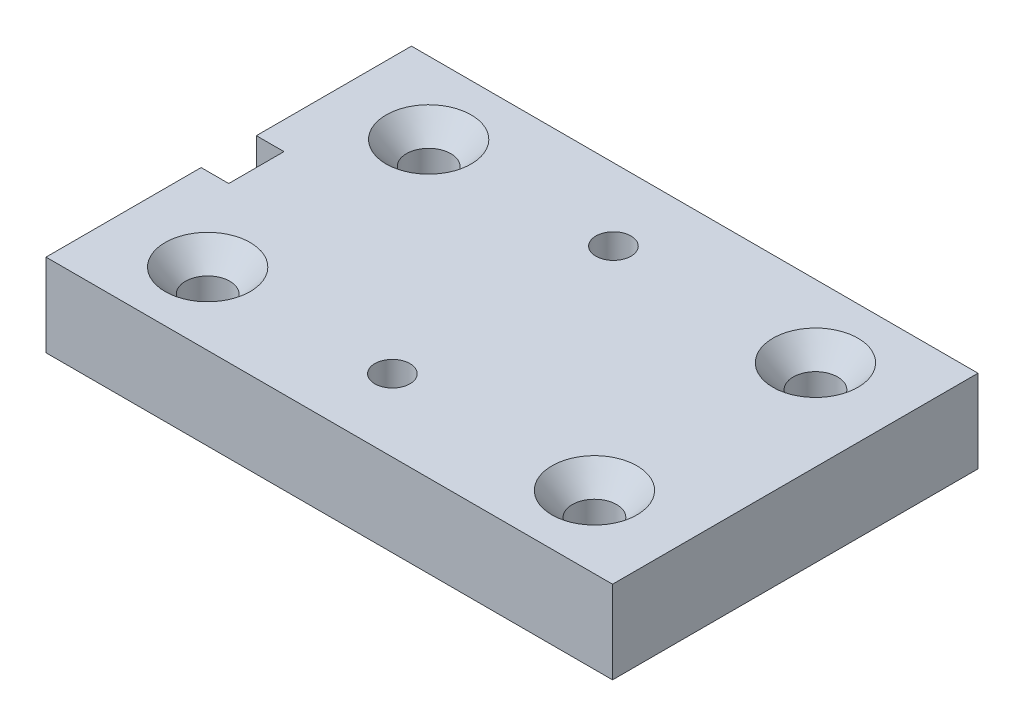
ISO-10303-21;
HEADER;
FILE_DESCRIPTION(('STEP AP214'),'2;1');
FILE_NAME('part.step','',(''),(''),'','','');
FILE_SCHEMA(('AUTOMOTIVE_DESIGN { 1 0 10303 214 1 1 1 1 }'));
ENDSEC;
DATA;
#1=APPLICATION_CONTEXT('core data for automotive mechanical design processes');
#2=APPLICATION_PROTOCOL_DEFINITION('international standard','automotive_design',2000,#1);
#3=PRODUCT_CONTEXT('',#1,'mechanical');
#4=PRODUCT('Part','Part','',(#3));
#5=PRODUCT_RELATED_PRODUCT_CATEGORY('part','',(#4));
#6=PRODUCT_DEFINITION_FORMATION('','',#4);
#7=PRODUCT_DEFINITION_CONTEXT('part definition',#1,'design');
#8=PRODUCT_DEFINITION('design','',#6,#7);
#9=PRODUCT_DEFINITION_SHAPE('','',#8);
#10=(LENGTH_UNIT() NAMED_UNIT(*) SI_UNIT(.MILLI.,.METRE.));
#11=(NAMED_UNIT(*) PLANE_ANGLE_UNIT() SI_UNIT($,.RADIAN.));
#12=(NAMED_UNIT(*) SI_UNIT($,.STERADIAN.) SOLID_ANGLE_UNIT());
#13=UNCERTAINTY_MEASURE_WITH_UNIT(LENGTH_MEASURE(1.E-05),#10,'distance_accuracy_value','');
#14=(GEOMETRIC_REPRESENTATION_CONTEXT(3) GLOBAL_UNCERTAINTY_ASSIGNED_CONTEXT((#13)) GLOBAL_UNIT_ASSIGNED_CONTEXT((#10,
#11,#12)) REPRESENTATION_CONTEXT('',''));
#15=CARTESIAN_POINT('',(0.,0.,0.));
#16=DIRECTION('',(0.,0.,1.));
#17=DIRECTION('',(1.,0.,0.));
#18=AXIS2_PLACEMENT_3D('',#15,#16,#17);
#19=CARTESIAN_POINT('',(-65.110000082,9.525,0.));
#20=DIRECTION('',(1.,0.,0.));
#21=DIRECTION('',(0.,0.,-1.));
#22=AXIS2_PLACEMENT_3D('',#19,#20,#21);
#23=PLANE('',#22);
#24=DIRECTION('',(0.,0.,1.));
#25=VECTOR('',#24,1.);
#26=CARTESIAN_POINT('',(-65.110000082,0.,0.));
#27=LINE('',#26,#25);
#28=CARTESIAN_POINT('',(-65.110000082,0.,-42.));
#29=VERTEX_POINT('',#28);
#30=CARTESIAN_POINT('',(-65.110000082,0.,-24.175));
#31=VERTEX_POINT('',#30);
#32=EDGE_CURVE('E129',#29,#31,#27,.T.);
#33=ORIENTED_EDGE('',*,*,#32,.T.);
#34=DIRECTION('',(0.,1.,0.));
#35=VECTOR('',#34,1.);
#36=CARTESIAN_POINT('',(-65.110000082,0.,-24.175));
#37=LINE('',#36,#35);
#38=CARTESIAN_POINT('',(-65.110000082,9.525,-24.175));
#39=VERTEX_POINT('',#38);
#40=EDGE_CURVE('E162',#31,#39,#37,.T.);
#41=ORIENTED_EDGE('',*,*,#40,.T.);
#42=DIRECTION('',(0.,0.,1.));
#43=VECTOR('',#42,1.);
#44=CARTESIAN_POINT('',(-65.110000082,9.525,0.));
#45=LINE('',#44,#43);
#46=CARTESIAN_POINT('',(-65.110000082,9.525,-42.));
#47=VERTEX_POINT('',#46);
#48=EDGE_CURVE('E148',#47,#39,#45,.T.);
#49=ORIENTED_EDGE('',*,*,#48,.F.);
#50=DIRECTION('',(0.,-1.,0.));
#51=VECTOR('',#50,1.);
#52=CARTESIAN_POINT('',(-65.110000082,9.525,-42.));
#53=LINE('',#52,#51);
#54=EDGE_CURVE('E43',#47,#29,#53,.T.);
#55=ORIENTED_EDGE('',*,*,#54,.T.);
#56=EDGE_LOOP('',(#33,#41,#49,#55));
#57=FACE_BOUND('',#56,.T.);
#58=ADVANCED_FACE('F35',(#57),#23,.F.);
#59=CARTESIAN_POINT('',(0.,9.525,0.));
#60=DIRECTION('',(-1.,0.,0.));
#61=DIRECTION('',(0.,0.,1.));
#62=AXIS2_PLACEMENT_3D('',#59,#60,#61);
#63=PLANE('',#62);
#64=DIRECTION('',(0.,0.,-1.));
#65=VECTOR('',#64,1.);
#66=CARTESIAN_POINT('',(0.,0.,0.));
#67=LINE('',#66,#65);
#68=CARTESIAN_POINT('',(0.,0.,0.));
#69=VERTEX_POINT('',#68);
#70=CARTESIAN_POINT('',(0.,0.,-42.));
#71=VERTEX_POINT('',#70);
#72=EDGE_CURVE('E133',#69,#71,#67,.T.);
#73=ORIENTED_EDGE('',*,*,#72,.T.);
#74=DIRECTION('',(0.,-1.,0.));
#75=VECTOR('',#74,1.);
#76=CARTESIAN_POINT('',(0.,9.525,-42.));
#77=LINE('',#76,#75);
#78=CARTESIAN_POINT('',(0.,9.525,-42.));
#79=VERTEX_POINT('',#78);
#80=EDGE_CURVE('E11',#79,#71,#77,.T.);
#81=ORIENTED_EDGE('',*,*,#80,.F.);
#82=DIRECTION('',(0.,0.,-1.));
#83=VECTOR('',#82,1.);
#84=CARTESIAN_POINT('',(0.,9.525,0.));
#85=LINE('',#84,#83);
#86=CARTESIAN_POINT('',(0.,9.525,0.));
#87=VERTEX_POINT('',#86);
#88=EDGE_CURVE('E138',#87,#79,#85,.T.);
#89=ORIENTED_EDGE('',*,*,#88,.F.);
#90=DIRECTION('',(0.,-1.,0.));
#91=VECTOR('',#90,1.);
#92=CARTESIAN_POINT('',(0.,9.525,0.));
#93=LINE('',#92,#91);
#94=EDGE_CURVE('E139',#87,#69,#93,.T.);
#95=ORIENTED_EDGE('',*,*,#94,.T.);
#96=EDGE_LOOP('',(#73,#81,#89,#95));
#97=FACE_BOUND('',#96,.T.);
#98=ADVANCED_FACE('F37',(#97),#63,.F.);
#99=CARTESIAN_POINT('',(0.,9.525,-42.));
#100=DIRECTION('',(0.,0.,1.));
#101=DIRECTION('',(1.,0.,0.));
#102=AXIS2_PLACEMENT_3D('',#99,#100,#101);
#103=PLANE('',#102);
#104=DIRECTION('',(-1.,0.,0.));
#105=VECTOR('',#104,1.);
#106=CARTESIAN_POINT('',(0.,0.,-42.));
#107=LINE('',#106,#105);
#108=EDGE_CURVE('E130',#71,#29,#107,.T.);
#109=ORIENTED_EDGE('',*,*,#108,.T.);
#110=ORIENTED_EDGE('',*,*,#54,.F.);
#111=DIRECTION('',(-1.,0.,0.));
#112=VECTOR('',#111,1.);
#113=CARTESIAN_POINT('',(0.,9.525,-42.));
#114=LINE('',#113,#112);
#115=EDGE_CURVE('E87',#79,#47,#114,.T.);
#116=ORIENTED_EDGE('',*,*,#115,.F.);
#117=ORIENTED_EDGE('',*,*,#80,.T.);
#118=EDGE_LOOP('',(#109,#110,#116,#117));
#119=FACE_BOUND('',#118,.T.);
#120=ADVANCED_FACE('F222',(#119),#103,.F.);
#121=CARTESIAN_POINT('',(-65.110000082,9.525,-17.825));
#122=VERTEX_POINT('',#121);
#123=CARTESIAN_POINT('',(-65.110000082,9.525,0.));
#124=VERTEX_POINT('',#123);
#125=EDGE_CURVE('E124',#122,#124,#45,.T.);
#126=ORIENTED_EDGE('',*,*,#125,.F.);
#127=DIRECTION('',(0.,1.,0.));
#128=VECTOR('',#127,1.);
#129=CARTESIAN_POINT('',(-65.110000082,0.,-17.825));
#130=LINE('',#129,#128);
#131=CARTESIAN_POINT('',(-65.110000082,0.,-17.825));
#132=VERTEX_POINT('',#131);
#133=EDGE_CURVE('E112',#132,#122,#130,.T.);
#134=ORIENTED_EDGE('',*,*,#133,.F.);
#135=CARTESIAN_POINT('',(-65.110000082,0.,0.));
#136=VERTEX_POINT('',#135);
#137=EDGE_CURVE('E123',#132,#136,#27,.T.);
#138=ORIENTED_EDGE('',*,*,#137,.T.);
#139=DIRECTION('',(0.,-1.,0.));
#140=VECTOR('',#139,1.);
#141=CARTESIAN_POINT('',(-65.110000082,9.525,0.));
#142=LINE('',#141,#140);
#143=EDGE_CURVE('E141',#124,#136,#142,.T.);
#144=ORIENTED_EDGE('',*,*,#143,.F.);
#145=EDGE_LOOP('',(#126,#134,#138,#144));
#146=FACE_BOUND('',#145,.T.);
#147=ADVANCED_FACE('F121',(#146),#23,.F.);
#148=CARTESIAN_POINT('',(0.,9.525,0.));
#149=DIRECTION('',(0.,0.,-1.));
#150=DIRECTION('',(-1.,0.,0.));
#151=AXIS2_PLACEMENT_3D('',#148,#149,#150);
#152=PLANE('',#151);
#153=DIRECTION('',(1.,0.,0.));
#154=VECTOR('',#153,1.);
#155=CARTESIAN_POINT('',(0.,0.,0.));
#156=LINE('',#155,#154);
#157=EDGE_CURVE('E80',#136,#69,#156,.T.);
#158=ORIENTED_EDGE('',*,*,#157,.T.);
#159=ORIENTED_EDGE('',*,*,#94,.F.);
#160=DIRECTION('',(1.,0.,0.));
#161=VECTOR('',#160,1.);
#162=CARTESIAN_POINT('',(0.,9.525,0.));
#163=LINE('',#162,#161);
#164=EDGE_CURVE('E59',#124,#87,#163,.T.);
#165=ORIENTED_EDGE('',*,*,#164,.F.);
#166=ORIENTED_EDGE('',*,*,#143,.T.);
#167=EDGE_LOOP('',(#158,#159,#165,#166));
#168=FACE_BOUND('',#167,.T.);
#169=ADVANCED_FACE('F210',(#168),#152,.F.);
#170=CARTESIAN_POINT('',(0.,9.525,0.));
#171=DIRECTION('',(0.,1.,0.));
#172=DIRECTION('',(0.,0.,1.));
#173=AXIS2_PLACEMENT_3D('',#170,#171,#172);
#174=PLANE('',#173);
#175=CARTESIAN_POINT('',(-33.600000082,9.525,-33.7));
#176=DIRECTION('',(0.,1.,0.));
#177=DIRECTION('',(0.,0.,1.));
#178=AXIS2_PLACEMENT_3D('',#175,#176,#177);
#179=CIRCLE('',#178,2.0193);
#180=CARTESIAN_POINT('',(-33.600000082,9.525,-31.6807));
#181=VERTEX_POINT('',#180);
#182=EDGE_CURVE('E426',#181,#181,#179,.T.);
#183=ORIENTED_EDGE('',*,*,#182,.F.);
#184=EDGE_LOOP('',(#183));
#185=FACE_BOUND('',#184,.T.);
#186=CARTESIAN_POINT('',(-33.600000082,9.525,-8.3));
#187=DIRECTION('',(0.,1.,0.));
#188=DIRECTION('',(0.,0.,1.));
#189=AXIS2_PLACEMENT_3D('',#186,#187,#188);
#190=CIRCLE('',#189,2.0193);
#191=CARTESIAN_POINT('',(-33.600000082,9.525,-6.2807));
#192=VERTEX_POINT('',#191);
#193=EDGE_CURVE('E158',#192,#192,#190,.T.);
#194=ORIENTED_EDGE('',*,*,#193,.F.);
#195=EDGE_LOOP('',(#194));
#196=FACE_BOUND('',#195,.T.);
#197=DIRECTION('',(-1.,0.,0.));
#198=VECTOR('',#197,1.);
#199=CARTESIAN_POINT('',(-65.110000082,9.525,-24.175));
#200=LINE('',#199,#198);
#201=CARTESIAN_POINT('',(-61.935000082,9.525,-24.175));
#202=VERTEX_POINT('',#201);
#203=EDGE_CURVE('E117',#202,#39,#200,.T.);
#204=ORIENTED_EDGE('',*,*,#203,.F.);
#205=DIRECTION('',(0.,0.,-1.));
#206=VECTOR('',#205,1.);
#207=CARTESIAN_POINT('',(-61.935000082,9.525,-24.175));
#208=LINE('',#207,#206);
#209=CARTESIAN_POINT('',(-61.935000082,9.525,-17.825));
#210=VERTEX_POINT('',#209);
#211=EDGE_CURVE('E157',#210,#202,#208,.T.);
#212=ORIENTED_EDGE('',*,*,#211,.F.);
#213=DIRECTION('',(1.,0.,0.));
#214=VECTOR('',#213,1.);
#215=CARTESIAN_POINT('',(-65.110000082,9.525,-17.825));
#216=LINE('',#215,#214);
#217=EDGE_CURVE('E155',#122,#210,#216,.T.);
#218=ORIENTED_EDGE('',*,*,#217,.F.);
#219=ORIENTED_EDGE('',*,*,#125,.T.);
#220=ORIENTED_EDGE('',*,*,#164,.T.);
#221=ORIENTED_EDGE('',*,*,#88,.T.);
#222=ORIENTED_EDGE('',*,*,#115,.T.);
#223=ORIENTED_EDGE('',*,*,#48,.T.);
#224=EDGE_LOOP('',(#204,#212,#218,#219,#220,#221,#222,#223));
#225=FACE_BOUND('',#224,.T.);
#226=CARTESIAN_POINT('',(-54.830000082,9.525,-33.7));
#227=DIRECTION('',(0.,1.,0.));
#228=DIRECTION('',(0.,0.,1.));
#229=AXIS2_PLACEMENT_3D('',#226,#227,#228);
#230=CIRCLE('',#229,4.8895);
#231=CARTESIAN_POINT('',(-54.830000082,9.525,-28.8105));
#232=VERTEX_POINT('',#231);
#233=EDGE_CURVE('E164',#232,#232,#230,.T.);
#234=ORIENTED_EDGE('',*,*,#233,.F.);
#235=EDGE_LOOP('',(#234));
#236=FACE_BOUND('',#235,.T.);
#237=CARTESIAN_POINT('',(-54.830000082,9.525,-8.29999999999999));
#238=DIRECTION('',(0.,1.,0.));
#239=DIRECTION('',(0.,0.,1.));
#240=AXIS2_PLACEMENT_3D('',#237,#238,#239);
#241=CIRCLE('',#240,4.8895);
#242=CARTESIAN_POINT('',(-54.830000082,9.525,-3.41049999999999));
#243=VERTEX_POINT('',#242);
#244=EDGE_CURVE('E176',#243,#243,#241,.T.);
#245=ORIENTED_EDGE('',*,*,#244,.F.);
#246=EDGE_LOOP('',(#245));
#247=FACE_BOUND('',#246,.T.);
#248=CARTESIAN_POINT('',(-10.3799894,9.525,-8.3));
#249=DIRECTION('',(0.,1.,0.));
#250=DIRECTION('',(0.,0.,1.));
#251=AXIS2_PLACEMENT_3D('',#248,#249,#250);
#252=CIRCLE('',#251,4.8895);
#253=CARTESIAN_POINT('',(-10.3799894,9.525,-3.4105));
#254=VERTEX_POINT('',#253);
#255=EDGE_CURVE('E185',#254,#254,#252,.T.);
#256=ORIENTED_EDGE('',*,*,#255,.F.);
#257=EDGE_LOOP('',(#256));
#258=FACE_BOUND('',#257,.T.);
#259=CARTESIAN_POINT('',(-10.3799894,9.525,-33.7));
#260=DIRECTION('',(0.,1.,0.));
#261=DIRECTION('',(0.,0.,1.));
#262=AXIS2_PLACEMENT_3D('',#259,#260,#261);
#263=CIRCLE('',#262,4.8895);
#264=CARTESIAN_POINT('',(-10.3799894,9.525,-28.8105));
#265=VERTEX_POINT('',#264);
#266=EDGE_CURVE('E194',#265,#265,#263,.T.);
#267=ORIENTED_EDGE('',*,*,#266,.F.);
#268=EDGE_LOOP('',(#267));
#269=FACE_BOUND('',#268,.T.);
#270=ADVANCED_FACE('F212',(#185,#196,#225,#236,#247,#258,#269),#174,.T.);
#271=CARTESIAN_POINT('',(0.,0.,0.));
#272=DIRECTION('',(0.,1.,0.));
#273=DIRECTION('',(0.,0.,1.));
#274=AXIS2_PLACEMENT_3D('',#271,#272,#273);
#275=PLANE('',#274);
#276=CARTESIAN_POINT('',(-33.600000082,0.,-33.7));
#277=DIRECTION('',(0.,1.,0.));
#278=DIRECTION('',(0.,0.,1.));
#279=AXIS2_PLACEMENT_3D('',#276,#277,#278);
#280=CIRCLE('',#279,2.0193);
#281=CARTESIAN_POINT('',(-33.600000082,0.,-31.6807));
#282=VERTEX_POINT('',#281);
#283=EDGE_CURVE('E423',#282,#282,#280,.T.);
#284=ORIENTED_EDGE('',*,*,#283,.T.);
#285=EDGE_LOOP('',(#284));
#286=FACE_BOUND('',#285,.T.);
#287=CARTESIAN_POINT('',(-33.600000082,0.,-8.3));
#288=DIRECTION('',(0.,1.,0.));
#289=DIRECTION('',(0.,0.,1.));
#290=AXIS2_PLACEMENT_3D('',#287,#288,#289);
#291=CIRCLE('',#290,2.0193);
#292=CARTESIAN_POINT('',(-33.600000082,0.,-6.2807));
#293=VERTEX_POINT('',#292);
#294=EDGE_CURVE('E427',#293,#293,#291,.T.);
#295=ORIENTED_EDGE('',*,*,#294,.T.);
#296=EDGE_LOOP('',(#295));
#297=FACE_BOUND('',#296,.T.);
#298=CARTESIAN_POINT('',(-54.830000082,0.,-33.7));
#299=DIRECTION('',(0.,1.,0.));
#300=DIRECTION('',(0.,0.,1.));
#301=AXIS2_PLACEMENT_3D('',#298,#299,#300);
#302=CIRCLE('',#301,2.5527);
#303=CARTESIAN_POINT('',(-54.830000082,0.,-31.1473));
#304=VERTEX_POINT('',#303);
#305=EDGE_CURVE('E173',#304,#304,#302,.T.);
#306=ORIENTED_EDGE('',*,*,#305,.T.);
#307=EDGE_LOOP('',(#306));
#308=FACE_BOUND('',#307,.T.);
#309=CARTESIAN_POINT('',(-54.830000082,0.,-8.29999999999999));
#310=DIRECTION('',(0.,1.,0.));
#311=DIRECTION('',(0.,0.,1.));
#312=AXIS2_PLACEMENT_3D('',#309,#310,#311);
#313=CIRCLE('',#312,2.5527);
#314=CARTESIAN_POINT('',(-54.830000082,0.,-5.74729999999999));
#315=VERTEX_POINT('',#314);
#316=EDGE_CURVE('E182',#315,#315,#313,.T.);
#317=ORIENTED_EDGE('',*,*,#316,.T.);
#318=EDGE_LOOP('',(#317));
#319=FACE_BOUND('',#318,.T.);
#320=CARTESIAN_POINT('',(-10.3799894,0.,-8.3));
#321=DIRECTION('',(0.,1.,0.));
#322=DIRECTION('',(0.,0.,1.));
#323=AXIS2_PLACEMENT_3D('',#320,#321,#322);
#324=CIRCLE('',#323,2.5527);
#325=CARTESIAN_POINT('',(-10.3799894,0.,-5.7473));
#326=VERTEX_POINT('',#325);
#327=EDGE_CURVE('E191',#326,#326,#324,.T.);
#328=ORIENTED_EDGE('',*,*,#327,.T.);
#329=EDGE_LOOP('',(#328));
#330=FACE_BOUND('',#329,.T.);
#331=CARTESIAN_POINT('',(-10.3799894,0.,-33.7));
#332=DIRECTION('',(0.,1.,0.));
#333=DIRECTION('',(0.,0.,1.));
#334=AXIS2_PLACEMENT_3D('',#331,#332,#333);
#335=CIRCLE('',#334,2.5527);
#336=CARTESIAN_POINT('',(-10.3799894,0.,-31.1473));
#337=VERTEX_POINT('',#336);
#338=EDGE_CURVE('E200',#337,#337,#335,.T.);
#339=ORIENTED_EDGE('',*,*,#338,.T.);
#340=EDGE_LOOP('',(#339));
#341=FACE_BOUND('',#340,.T.);
#342=DIRECTION('',(0.,0.,-1.));
#343=VECTOR('',#342,1.);
#344=CARTESIAN_POINT('',(-61.935000082,0.,-24.175));
#345=LINE('',#344,#343);
#346=CARTESIAN_POINT('',(-61.935000082,0.,-17.825));
#347=VERTEX_POINT('',#346);
#348=CARTESIAN_POINT('',(-61.935000082,0.,-24.175));
#349=VERTEX_POINT('',#348);
#350=EDGE_CURVE('E50',#347,#349,#345,.T.);
#351=ORIENTED_EDGE('',*,*,#350,.T.);
#352=DIRECTION('',(-1.,0.,0.));
#353=VECTOR('',#352,1.);
#354=CARTESIAN_POINT('',(-65.110000082,0.,-24.175));
#355=LINE('',#354,#353);
#356=EDGE_CURVE('E125',#349,#31,#355,.T.);
#357=ORIENTED_EDGE('',*,*,#356,.T.);
#358=ORIENTED_EDGE('',*,*,#32,.F.);
#359=ORIENTED_EDGE('',*,*,#108,.F.);
#360=ORIENTED_EDGE('',*,*,#72,.F.);
#361=ORIENTED_EDGE('',*,*,#157,.F.);
#362=ORIENTED_EDGE('',*,*,#137,.F.);
#363=DIRECTION('',(1.,0.,0.));
#364=VECTOR('',#363,1.);
#365=CARTESIAN_POINT('',(-65.110000082,0.,-17.825));
#366=LINE('',#365,#364);
#367=EDGE_CURVE('E108',#132,#347,#366,.T.);
#368=ORIENTED_EDGE('',*,*,#367,.T.);
#369=EDGE_LOOP('',(#351,#357,#358,#359,#360,#361,#362,#368));
#370=FACE_BOUND('',#369,.T.);
#371=ADVANCED_FACE('F127',(#286,#297,#308,#319,#330,#341,#370),#275,.F.);
#372=CARTESIAN_POINT('',(-10.3799894,9.525,-33.7));
#373=DIRECTION('',(0.,1.,0.));
#374=DIRECTION('',(0.,0.,1.));
#375=AXIS2_PLACEMENT_3D('',#372,#373,#374);
#376=CYLINDRICAL_SURFACE('',#375,2.5527);
#377=ORIENTED_EDGE('',*,*,#338,.F.);
#378=EDGE_LOOP('',(#377));
#379=FACE_BOUND('',#378,.T.);
#380=CARTESIAN_POINT('',(-10.3799894,6.83681910600595,-33.7));
#381=DIRECTION('',(0.,1.,0.));
#382=DIRECTION('',(0.,0.,1.));
#383=AXIS2_PLACEMENT_3D('',#380,#381,#382);
#384=CIRCLE('',#383,2.5527);
#385=CARTESIAN_POINT('',(-10.3799894,6.83681910600595,-31.1473));
#386=VERTEX_POINT('',#385);
#387=EDGE_CURVE('E197',#386,#386,#384,.T.);
#388=ORIENTED_EDGE('',*,*,#387,.T.);
#389=EDGE_LOOP('',(#388));
#390=FACE_BOUND('',#389,.T.);
#391=ADVANCED_FACE('F281',(#379,#390),#376,.F.);
#392=CARTESIAN_POINT('',(-10.3799894,9.525,-33.7));
#393=DIRECTION('',(0.,1.,0.));
#394=DIRECTION('',(0.,0.,1.));
#395=AXIS2_PLACEMENT_3D('',#392,#393,#394);
#396=CONICAL_SURFACE('',#395,4.8895,0.715584993317675);
#397=ORIENTED_EDGE('',*,*,#387,.F.);
#398=EDGE_LOOP('',(#397));
#399=FACE_BOUND('',#398,.T.);
#400=ORIENTED_EDGE('',*,*,#266,.T.);
#401=EDGE_LOOP('',(#400));
#402=FACE_BOUND('',#401,.T.);
#403=ADVANCED_FACE('F331',(#399,#402),#396,.F.);
#404=CARTESIAN_POINT('',(-10.3799894,9.525,-8.3));
#405=DIRECTION('',(0.,1.,0.));
#406=DIRECTION('',(0.,0.,1.));
#407=AXIS2_PLACEMENT_3D('',#404,#405,#406);
#408=CYLINDRICAL_SURFACE('',#407,2.5527);
#409=ORIENTED_EDGE('',*,*,#327,.F.);
#410=EDGE_LOOP('',(#409));
#411=FACE_BOUND('',#410,.T.);
#412=CARTESIAN_POINT('',(-10.3799894,6.83681910600595,-8.3));
#413=DIRECTION('',(0.,1.,0.));
#414=DIRECTION('',(0.,0.,1.));
#415=AXIS2_PLACEMENT_3D('',#412,#413,#414);
#416=CIRCLE('',#415,2.5527);
#417=CARTESIAN_POINT('',(-10.3799894,6.83681910600595,-5.7473));
#418=VERTEX_POINT('',#417);
#419=EDGE_CURVE('E188',#418,#418,#416,.T.);
#420=ORIENTED_EDGE('',*,*,#419,.T.);
#421=EDGE_LOOP('',(#420));
#422=FACE_BOUND('',#421,.T.);
#423=ADVANCED_FACE('F327',(#411,#422),#408,.F.);
#424=CARTESIAN_POINT('',(-10.3799894,9.525,-8.3));
#425=DIRECTION('',(0.,1.,0.));
#426=DIRECTION('',(0.,0.,1.));
#427=AXIS2_PLACEMENT_3D('',#424,#425,#426);
#428=CONICAL_SURFACE('',#427,4.8895,0.715584993317675);
#429=ORIENTED_EDGE('',*,*,#419,.F.);
#430=EDGE_LOOP('',(#429));
#431=FACE_BOUND('',#430,.T.);
#432=ORIENTED_EDGE('',*,*,#255,.T.);
#433=EDGE_LOOP('',(#432));
#434=FACE_BOUND('',#433,.T.);
#435=ADVANCED_FACE('F323',(#431,#434),#428,.F.);
#436=CARTESIAN_POINT('',(-54.830000082,9.525,-8.29999999999999));
#437=DIRECTION('',(0.,1.,0.));
#438=DIRECTION('',(0.,0.,1.));
#439=AXIS2_PLACEMENT_3D('',#436,#437,#438);
#440=CYLINDRICAL_SURFACE('',#439,2.5527);
#441=ORIENTED_EDGE('',*,*,#316,.F.);
#442=EDGE_LOOP('',(#441));
#443=FACE_BOUND('',#442,.T.);
#444=CARTESIAN_POINT('',(-54.830000082,6.83681910600595,-8.29999999999999));
#445=DIRECTION('',(0.,1.,0.));
#446=DIRECTION('',(0.,0.,1.));
#447=AXIS2_PLACEMENT_3D('',#444,#445,#446);
#448=CIRCLE('',#447,2.5527);
#449=CARTESIAN_POINT('',(-54.830000082,6.83681910600595,-5.74729999999999));
#450=VERTEX_POINT('',#449);
#451=EDGE_CURVE('E179',#450,#450,#448,.T.);
#452=ORIENTED_EDGE('',*,*,#451,.T.);
#453=EDGE_LOOP('',(#452));
#454=FACE_BOUND('',#453,.T.);
#455=ADVANCED_FACE('F319',(#443,#454),#440,.F.);
#456=CARTESIAN_POINT('',(-54.830000082,9.525,-8.29999999999999));
#457=DIRECTION('',(0.,1.,0.));
#458=DIRECTION('',(0.,0.,1.));
#459=AXIS2_PLACEMENT_3D('',#456,#457,#458);
#460=CONICAL_SURFACE('',#459,4.8895,0.715584993317675);
#461=ORIENTED_EDGE('',*,*,#451,.F.);
#462=EDGE_LOOP('',(#461));
#463=FACE_BOUND('',#462,.T.);
#464=ORIENTED_EDGE('',*,*,#244,.T.);
#465=EDGE_LOOP('',(#464));
#466=FACE_BOUND('',#465,.T.);
#467=ADVANCED_FACE('F315',(#463,#466),#460,.F.);
#468=CARTESIAN_POINT('',(-54.830000082,9.525,-33.7));
#469=DIRECTION('',(0.,1.,0.));
#470=DIRECTION('',(0.,0.,1.));
#471=AXIS2_PLACEMENT_3D('',#468,#469,#470);
#472=CYLINDRICAL_SURFACE('',#471,2.5527);
#473=ORIENTED_EDGE('',*,*,#305,.F.);
#474=EDGE_LOOP('',(#473));
#475=FACE_BOUND('',#474,.T.);
#476=CARTESIAN_POINT('',(-54.830000082,6.83681910600595,-33.7));
#477=DIRECTION('',(0.,1.,0.));
#478=DIRECTION('',(0.,0.,1.));
#479=AXIS2_PLACEMENT_3D('',#476,#477,#478);
#480=CIRCLE('',#479,2.5527);
#481=CARTESIAN_POINT('',(-54.830000082,6.83681910600595,-31.1473));
#482=VERTEX_POINT('',#481);
#483=EDGE_CURVE('E170',#482,#482,#480,.T.);
#484=ORIENTED_EDGE('',*,*,#483,.T.);
#485=EDGE_LOOP('',(#484));
#486=FACE_BOUND('',#485,.T.);
#487=ADVANCED_FACE('F311',(#475,#486),#472,.F.);
#488=CARTESIAN_POINT('',(-54.830000082,9.525,-33.7));
#489=DIRECTION('',(0.,1.,0.));
#490=DIRECTION('',(0.,0.,1.));
#491=AXIS2_PLACEMENT_3D('',#488,#489,#490);
#492=CONICAL_SURFACE('',#491,4.8895,0.715584993317675);
#493=ORIENTED_EDGE('',*,*,#483,.F.);
#494=EDGE_LOOP('',(#493));
#495=FACE_BOUND('',#494,.T.);
#496=ORIENTED_EDGE('',*,*,#233,.T.);
#497=EDGE_LOOP('',(#496));
#498=FACE_BOUND('',#497,.T.);
#499=ADVANCED_FACE('F250',(#495,#498),#492,.F.);
#500=CARTESIAN_POINT('',(-65.110000082,0.,-24.175));
#501=DIRECTION('',(0.,0.,-1.));
#502=DIRECTION('',(-1.,0.,0.));
#503=AXIS2_PLACEMENT_3D('',#500,#501,#502);
#504=PLANE('',#503);
#505=ORIENTED_EDGE('',*,*,#203,.T.);
#506=ORIENTED_EDGE('',*,*,#40,.F.);
#507=ORIENTED_EDGE('',*,*,#356,.F.);
#508=DIRECTION('',(0.,1.,0.));
#509=VECTOR('',#508,1.);
#510=CARTESIAN_POINT('',(-61.935000082,0.,-24.175));
#511=LINE('',#510,#509);
#512=EDGE_CURVE('E165',#349,#202,#511,.T.);
#513=ORIENTED_EDGE('',*,*,#512,.T.);
#514=EDGE_LOOP('',(#505,#506,#507,#513));
#515=FACE_BOUND('',#514,.T.);
#516=ADVANCED_FACE('F244',(#515),#504,.F.);
#517=CARTESIAN_POINT('',(-61.935000082,0.,-24.175));
#518=DIRECTION('',(1.,0.,0.));
#519=DIRECTION('',(0.,0.,-1.));
#520=AXIS2_PLACEMENT_3D('',#517,#518,#519);
#521=PLANE('',#520);
#522=ORIENTED_EDGE('',*,*,#211,.T.);
#523=ORIENTED_EDGE('',*,*,#512,.F.);
#524=ORIENTED_EDGE('',*,*,#350,.F.);
#525=DIRECTION('',(0.,1.,0.));
#526=VECTOR('',#525,1.);
#527=CARTESIAN_POINT('',(-61.935000082,0.,-17.825));
#528=LINE('',#527,#526);
#529=EDGE_CURVE('E114',#347,#210,#528,.T.);
#530=ORIENTED_EDGE('',*,*,#529,.T.);
#531=EDGE_LOOP('',(#522,#523,#524,#530));
#532=FACE_BOUND('',#531,.T.);
#533=ADVANCED_FACE('F249',(#532),#521,.F.);
#534=CARTESIAN_POINT('',(-65.110000082,0.,-17.825));
#535=DIRECTION('',(0.,0.,1.));
#536=DIRECTION('',(1.,0.,0.));
#537=AXIS2_PLACEMENT_3D('',#534,#535,#536);
#538=PLANE('',#537);
#539=ORIENTED_EDGE('',*,*,#217,.T.);
#540=ORIENTED_EDGE('',*,*,#529,.F.);
#541=ORIENTED_EDGE('',*,*,#367,.F.);
#542=ORIENTED_EDGE('',*,*,#133,.T.);
#543=EDGE_LOOP('',(#539,#540,#541,#542));
#544=FACE_BOUND('',#543,.T.);
#545=ADVANCED_FACE('F111',(#544),#538,.F.);
#546=CARTESIAN_POINT('',(-33.600000082,9.525,-8.3));
#547=DIRECTION('',(0.,1.,0.));
#548=DIRECTION('',(0.,0.,1.));
#549=AXIS2_PLACEMENT_3D('',#546,#547,#548);
#550=CYLINDRICAL_SURFACE('',#549,2.0193);
#551=ORIENTED_EDGE('',*,*,#294,.F.);
#552=EDGE_LOOP('',(#551));
#553=FACE_BOUND('',#552,.T.);
#554=ORIENTED_EDGE('',*,*,#193,.T.);
#555=EDGE_LOOP('',(#554));
#556=FACE_BOUND('',#555,.T.);
#557=ADVANCED_FACE('F267',(#553,#556),#550,.F.);
#558=CARTESIAN_POINT('',(-33.600000082,9.525,-33.7));
#559=DIRECTION('',(0.,1.,0.));
#560=DIRECTION('',(0.,0.,1.));
#561=AXIS2_PLACEMENT_3D('',#558,#559,#560);
#562=CYLINDRICAL_SURFACE('',#561,2.0193);
#563=ORIENTED_EDGE('',*,*,#283,.F.);
#564=EDGE_LOOP('',(#563));
#565=FACE_BOUND('',#564,.T.);
#566=ORIENTED_EDGE('',*,*,#182,.T.);
#567=EDGE_LOOP('',(#566));
#568=FACE_BOUND('',#567,.T.);
#569=ADVANCED_FACE('F289',(#565,#568),#562,.F.);
#570=CLOSED_SHELL('',(#58,#98,#120,#147,#169,#270,#371,#391,#403,#423,#435,#455,#467,#487,#499,
#516,#533,#545,#557,#569));
#571=MANIFOLD_SOLID_BREP('B2',#570);
#572=ADVANCED_BREP_SHAPE_REPRESENTATION('',(#18,#571),#14);
#573=SHAPE_DEFINITION_REPRESENTATION(#9,#572);
ENDSEC;
END-ISO-10303-21;
